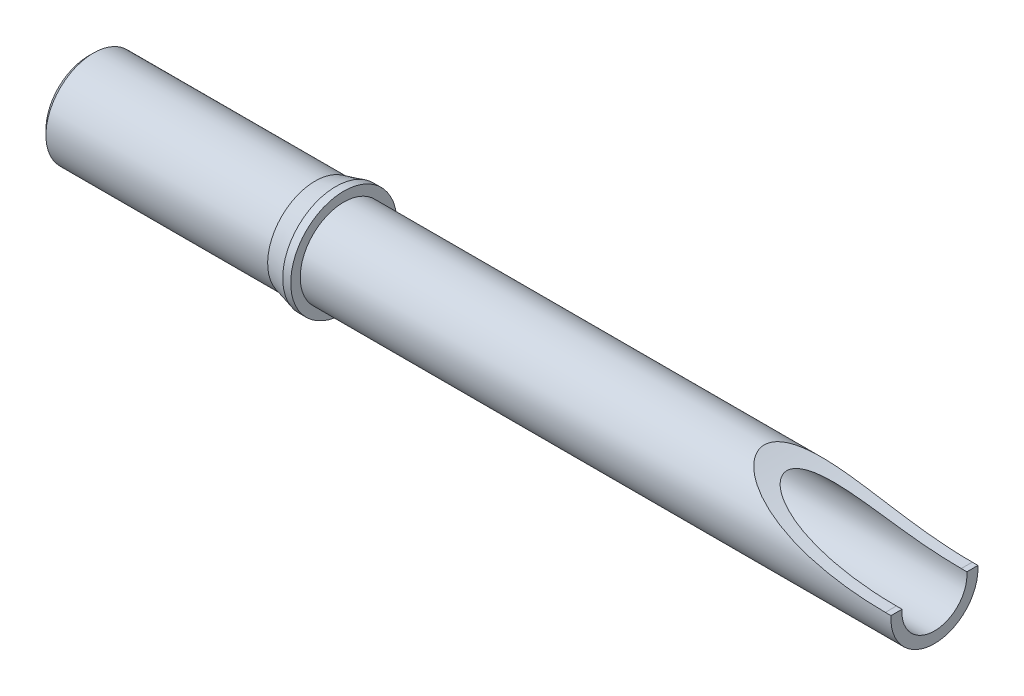
ISO-10303-21;
HEADER;
FILE_DESCRIPTION(('STEP AP214'),'2;1');
FILE_NAME('part.step','',(''),(''),'','','');
FILE_SCHEMA(('AUTOMOTIVE_DESIGN { 1 0 10303 214 1 1 1 1 }'));
ENDSEC;
DATA;
#1=APPLICATION_CONTEXT('core data for automotive mechanical design processes');
#2=APPLICATION_PROTOCOL_DEFINITION('international standard','automotive_design',2000,#1);
#3=PRODUCT_CONTEXT('',#1,'mechanical');
#4=PRODUCT('Part','Part','',(#3));
#5=PRODUCT_RELATED_PRODUCT_CATEGORY('part','',(#4));
#6=PRODUCT_DEFINITION_FORMATION('','',#4);
#7=PRODUCT_DEFINITION_CONTEXT('part definition',#1,'design');
#8=PRODUCT_DEFINITION('design','',#6,#7);
#9=PRODUCT_DEFINITION_SHAPE('','',#8);
#10=(LENGTH_UNIT() NAMED_UNIT(*) SI_UNIT(.MILLI.,.METRE.));
#11=(NAMED_UNIT(*) PLANE_ANGLE_UNIT() SI_UNIT($,.RADIAN.));
#12=(NAMED_UNIT(*) SI_UNIT($,.STERADIAN.) SOLID_ANGLE_UNIT());
#13=UNCERTAINTY_MEASURE_WITH_UNIT(LENGTH_MEASURE(1.E-05),#10,'distance_accuracy_value','');
#14=(GEOMETRIC_REPRESENTATION_CONTEXT(3) GLOBAL_UNCERTAINTY_ASSIGNED_CONTEXT((#13)) GLOBAL_UNIT_ASSIGNED_CONTEXT((#10,
#11,#12)) REPRESENTATION_CONTEXT('',''));
#15=CARTESIAN_POINT('',(0.,0.,0.));
#16=DIRECTION('',(0.,0.,1.));
#17=DIRECTION('',(1.,0.,0.));
#18=AXIS2_PLACEMENT_3D('',#15,#16,#17);
#19=CARTESIAN_POINT('',(3.84999999999991,0.,0.));
#20=DIRECTION('',(-1.,0.,0.));
#21=DIRECTION('',(0.,0.,1.));
#22=AXIS2_PLACEMENT_3D('',#19,#20,#21);
#23=CONICAL_SURFACE('',#22,0.315000000000509,1.04719755087034);
#24=CARTESIAN_POINT('',(4.0318653348379,-2.8421709430404E-11,0.));
#25=VERTEX_POINT('',#24);
#26=VERTEX_LOOP('',#25);
#27=FACE_BOUND('',#26,.T.);
#28=CARTESIAN_POINT('',(3.85,0.,0.));
#29=DIRECTION('',(-1.,0.,0.));
#30=DIRECTION('',(0.,0.,1.));
#31=AXIS2_PLACEMENT_3D('',#28,#29,#30);
#32=CIRCLE('',#31,0.315);
#33=CARTESIAN_POINT('',(3.85,0.,0.315));
#34=VERTEX_POINT('',#33);
#35=EDGE_CURVE('E69',#34,#34,#32,.T.);
#36=ORIENTED_EDGE('',*,*,#35,.T.);
#37=EDGE_LOOP('',(#36));
#38=FACE_BOUND('',#37,.T.);
#39=ADVANCED_FACE('F17',(#27,#38),#23,.F.);
#40=CARTESIAN_POINT('',(3.07598076211353,0.,0.));
#41=DIRECTION('',(-1.,0.,0.));
#42=DIRECTION('',(0.,0.,1.));
#43=AXIS2_PLACEMENT_3D('',#40,#41,#42);
#44=CYLINDRICAL_SURFACE('',#43,0.315);
#45=CARTESIAN_POINT('',(2.30196152421058,0.,0.));
#46=DIRECTION('',(-1.,0.,0.));
#47=DIRECTION('',(0.,1.,0.));
#48=AXIS2_PLACEMENT_3D('',#45,#46,#47);
#49=CIRCLE('',#48,0.315000000000509);
#50=CARTESIAN_POINT('',(2.30196152421058,0.315000000000509,0.));
#51=VERTEX_POINT('',#50);
#52=EDGE_CURVE('E71',#51,#51,#49,.T.);
#53=ORIENTED_EDGE('',*,*,#52,.T.);
#54=EDGE_LOOP('',(#53));
#55=FACE_BOUND('',#54,.T.);
#56=ORIENTED_EDGE('',*,*,#35,.F.);
#57=EDGE_LOOP('',(#56));
#58=FACE_BOUND('',#57,.T.);
#59=ADVANCED_FACE('F66',(#55,#58),#44,.F.);
#60=CARTESIAN_POINT('',(2.25000000000364,0.,0.));
#61=DIRECTION('',(-1.,0.,0.));
#62=DIRECTION('',(0.,0.,1.));
#63=AXIS2_PLACEMENT_3D('',#60,#61,#62);
#64=CONICAL_SURFACE('',#63,0.405000000000655,1.04719755136498);
#65=CARTESIAN_POINT('',(2.25,0.,0.));
#66=DIRECTION('',(-1.,0.,0.));
#67=DIRECTION('',(0.,0.,1.));
#68=AXIS2_PLACEMENT_3D('',#65,#66,#67);
#69=CIRCLE('',#68,0.405);
#70=CARTESIAN_POINT('',(2.25,0.,0.405));
#71=VERTEX_POINT('',#70);
#72=EDGE_CURVE('E74',#71,#71,#69,.T.);
#73=ORIENTED_EDGE('',*,*,#72,.T.);
#74=EDGE_LOOP('',(#73));
#75=FACE_BOUND('',#74,.T.);
#76=ORIENTED_EDGE('',*,*,#52,.F.);
#77=EDGE_LOOP('',(#76));
#78=FACE_BOUND('',#77,.T.);
#79=ADVANCED_FACE('F196',(#75,#78),#64,.F.);
#80=CARTESIAN_POINT('',(1.125,0.,0.));
#81=DIRECTION('',(-1.,0.,0.));
#82=DIRECTION('',(0.,0.,1.));
#83=AXIS2_PLACEMENT_3D('',#80,#81,#82);
#84=CYLINDRICAL_SURFACE('',#83,0.405);
#85=CARTESIAN_POINT('',(0.,0.,0.));
#86=DIRECTION('',(-1.,0.,0.));
#87=DIRECTION('',(0.,0.,1.));
#88=AXIS2_PLACEMENT_3D('',#85,#86,#87);
#89=CIRCLE('',#88,0.405);
#90=CARTESIAN_POINT('',(0.,0.,0.405));
#91=VERTEX_POINT('',#90);
#92=EDGE_CURVE('E20',#91,#91,#89,.T.);
#93=ORIENTED_EDGE('',*,*,#92,.T.);
#94=EDGE_LOOP('',(#93));
#95=FACE_BOUND('',#94,.T.);
#96=ORIENTED_EDGE('',*,*,#72,.F.);
#97=EDGE_LOOP('',(#96));
#98=FACE_BOUND('',#97,.T.);
#99=ADVANCED_FACE('F192',(#95,#98),#84,.F.);
#100=CARTESIAN_POINT('',(0.,-0.415,0.));
#101=DIRECTION('',(1.,0.,0.));
#102=DIRECTION('',(0.,0.,-1.));
#103=AXIS2_PLACEMENT_3D('',#100,#101,#102);
#104=PLANE('',#103);
#105=CARTESIAN_POINT('',(0.,0.,0.));
#106=DIRECTION('',(1.,0.,0.));
#107=DIRECTION('',(0.,0.,-1.));
#108=AXIS2_PLACEMENT_3D('',#105,#106,#107);
#109=CIRCLE('',#108,0.425000000007003);
#110=CARTESIAN_POINT('',(0.,0.,-0.425000000007003));
#111=VERTEX_POINT('',#110);
#112=EDGE_CURVE('E146',#111,#111,#109,.T.);
#113=ORIENTED_EDGE('',*,*,#112,.F.);
#114=EDGE_LOOP('',(#113));
#115=FACE_BOUND('',#114,.T.);
#116=ORIENTED_EDGE('',*,*,#92,.F.);
#117=EDGE_LOOP('',(#116));
#118=FACE_BOUND('',#117,.T.);
#119=ADVANCED_FACE('F189',(#115,#118),#104,.F.);
#120=CARTESIAN_POINT('',(0.049999999987449,0.,0.));
#121=DIRECTION('',(1.,0.,0.));
#122=DIRECTION('',(0.,0.,-1.));
#123=AXIS2_PLACEMENT_3D('',#120,#121,#122);
#124=CONICAL_SURFACE('',#123,0.474999999994452,0.785398163397448);
#125=ORIENTED_EDGE('',*,*,#112,.T.);
#126=EDGE_LOOP('',(#125));
#127=FACE_BOUND('',#126,.T.);
#128=CARTESIAN_POINT('',(0.0499999999999999,0.,0.));
#129=DIRECTION('',(1.,0.,0.));
#130=DIRECTION('',(0.,0.,-1.));
#131=AXIS2_PLACEMENT_3D('',#128,#129,#130);
#132=CIRCLE('',#131,0.475);
#133=CARTESIAN_POINT('',(0.0499999999999999,0.,-0.475));
#134=VERTEX_POINT('',#133);
#135=EDGE_CURVE('E144',#134,#134,#132,.T.);
#136=ORIENTED_EDGE('',*,*,#135,.F.);
#137=EDGE_LOOP('',(#136));
#138=FACE_BOUND('',#137,.T.);
#139=ADVANCED_FACE('F185',(#127,#138),#124,.T.);
#140=CARTESIAN_POINT('',(1.15736860279186,0.,0.));
#141=DIRECTION('',(1.,0.,0.));
#142=DIRECTION('',(0.,0.,-1.));
#143=AXIS2_PLACEMENT_3D('',#140,#141,#142);
#144=CYLINDRICAL_SURFACE('',#143,0.475);
#145=ORIENTED_EDGE('',*,*,#135,.T.);
#146=EDGE_LOOP('',(#145));
#147=FACE_BOUND('',#146,.T.);
#148=CARTESIAN_POINT('',(2.26473720556442,0.,0.));
#149=DIRECTION('',(1.,0.,0.));
#150=DIRECTION('',(0.,-1.,0.));
#151=AXIS2_PLACEMENT_3D('',#148,#149,#150);
#152=CIRCLE('',#151,0.474999999994452);
#153=CARTESIAN_POINT('',(2.26473720556442,-0.474999999994452,0.));
#154=VERTEX_POINT('',#153);
#155=EDGE_CURVE('E141',#154,#154,#152,.T.);
#156=ORIENTED_EDGE('',*,*,#155,.F.);
#157=EDGE_LOOP('',(#156));
#158=FACE_BOUND('',#157,.T.);
#159=ADVANCED_FACE('F181',(#147,#158),#144,.T.);
#160=CARTESIAN_POINT('',(2.47000000001663,0.,0.));
#161=DIRECTION('',(1.,0.,0.));
#162=DIRECTION('',(0.,0.,-1.));
#163=AXIS2_PLACEMENT_3D('',#160,#161,#162);
#164=CONICAL_SURFACE('',#163,0.530000000026121,0.261799387899347);
#165=ORIENTED_EDGE('',*,*,#155,.T.);
#166=EDGE_LOOP('',(#165));
#167=FACE_BOUND('',#166,.T.);
#168=CARTESIAN_POINT('',(2.47,0.,0.));
#169=DIRECTION('',(1.,0.,0.));
#170=DIRECTION('',(0.,0.,-1.));
#171=AXIS2_PLACEMENT_3D('',#168,#169,#170);
#172=CIRCLE('',#171,0.53);
#173=CARTESIAN_POINT('',(2.47,0.,-0.53));
#174=VERTEX_POINT('',#173);
#175=EDGE_CURVE('E136',#174,#174,#172,.T.);
#176=ORIENTED_EDGE('',*,*,#175,.F.);
#177=EDGE_LOOP('',(#176));
#178=FACE_BOUND('',#177,.T.);
#179=ADVANCED_FACE('F178',(#167,#178),#164,.T.);
#180=CARTESIAN_POINT('',(6.45000000002938,0.,0.));
#181=DIRECTION('',(1.,0.,0.));
#182=DIRECTION('',(0.,0.,-1.));
#183=AXIS2_PLACEMENT_3D('',#180,#181,#182);
#184=CONICAL_SURFACE('',#183,0.325000000032105,1.04719755106167);
#185=CARTESIAN_POINT('',(6.26236116249856,8.5265128291212E-11,0.));
#186=VERTEX_POINT('',#185);
#187=VERTEX_LOOP('',#186);
#188=FACE_BOUND('',#187,.T.);
#189=CARTESIAN_POINT('',(6.45,0.,0.));
#190=DIRECTION('',(-1.,0.,0.));
#191=DIRECTION('',(0.,0.,1.));
#192=AXIS2_PLACEMENT_3D('',#189,#190,#191);
#193=CIRCLE('',#192,0.325);
#194=CARTESIAN_POINT('',(6.45,0.,0.325));
#195=VERTEX_POINT('',#194);
#196=EDGE_CURVE('E134',#195,#195,#193,.F.);
#197=ORIENTED_EDGE('',*,*,#196,.T.);
#198=EDGE_LOOP('',(#197));
#199=FACE_BOUND('',#198,.T.);
#200=ADVANCED_FACE('F174',(#188,#199),#184,.F.);
#201=CARTESIAN_POINT('',(2.51,0.,0.));
#202=DIRECTION('',(1.,0.,0.));
#203=DIRECTION('',(0.,0.,-1.));
#204=AXIS2_PLACEMENT_3D('',#201,#202,#203);
#205=CYLINDRICAL_SURFACE('',#204,0.53);
#206=ORIENTED_EDGE('',*,*,#175,.T.);
#207=EDGE_LOOP('',(#206));
#208=FACE_BOUND('',#207,.T.);
#209=CARTESIAN_POINT('',(2.55,0.,0.));
#210=DIRECTION('',(1.,0.,0.));
#211=DIRECTION('',(0.,0.,-1.));
#212=AXIS2_PLACEMENT_3D('',#209,#210,#211);
#213=CIRCLE('',#212,0.53);
#214=CARTESIAN_POINT('',(2.55,0.,-0.53));
#215=VERTEX_POINT('',#214);
#216=EDGE_CURVE('E126',#215,#215,#213,.T.);
#217=ORIENTED_EDGE('',*,*,#216,.F.);
#218=EDGE_LOOP('',(#217));
#219=FACE_BOUND('',#218,.T.);
#220=ADVANCED_FACE('F171',(#208,#219),#205,.T.);
#221=CARTESIAN_POINT('',(8.741134,0.0250000000000025,-0.6360024));
#222=DIRECTION('',(0.,-1.,0.));
#223=DIRECTION('',(0.,0.,-1.));
#224=AXIS2_PLACEMENT_3D('',#221,#222,#223);
#225=PLANE('',#224);
#226=DIRECTION('',(0.,0.,-1.));
#227=VECTOR('',#226,1.);
#228=CARTESIAN_POINT('',(8.45,0.0250000000000023,0.));
#229=LINE('',#228,#227);
#230=CARTESIAN_POINT('',(8.45,0.0250000000000023,0.324037034920393));
#231=VERTEX_POINT('',#230);
#232=CARTESIAN_POINT('',(8.45,0.0250000000000024,0.434281015012169));
#233=VERTEX_POINT('',#232);
#234=EDGE_CURVE('E130',#231,#233,#229,.F.);
#235=ORIENTED_EDGE('',*,*,#234,.F.);
#236=DIRECTION('',(-1.,0.,0.));
#237=VECTOR('',#236,1.);
#238=CARTESIAN_POINT('',(7.45,0.0250000000000023,0.324037034920393));
#239=LINE('',#238,#237);
#240=CARTESIAN_POINT('',(8.39374572243609,0.0249999999943942,0.324037034920825));
#241=VERTEX_POINT('',#240);
#242=EDGE_CURVE('E58',#231,#241,#239,.T.);
#243=ORIENTED_EDGE('',*,*,#242,.T.);
#244=DIRECTION('',(0.,0.,1.));
#245=VECTOR('',#244,1.);
#246=CARTESIAN_POINT('',(8.39374572243609,0.0249999999999998,-0.6360024));
#247=LINE('',#246,#245);
#248=CARTESIAN_POINT('',(8.39374572243199,0.0250000000000012,0.434281015012169));
#249=VERTEX_POINT('',#248);
#250=EDGE_CURVE('E120',#241,#249,#247,.T.);
#251=ORIENTED_EDGE('',*,*,#250,.T.);
#252=DIRECTION('',(1.,0.,0.));
#253=VECTOR('',#252,1.);
#254=CARTESIAN_POINT('',(5.5,0.0250000000000025,0.434281015012169));
#255=LINE('',#254,#253);
#256=EDGE_CURVE('E117',#233,#249,#255,.F.);
#257=ORIENTED_EDGE('',*,*,#256,.F.);
#258=EDGE_LOOP('',(#235,#243,#251,#257));
#259=FACE_BOUND('',#258,.T.);
#260=ADVANCED_FACE('F122',(#259),#225,.F.);
#261=CARTESIAN_POINT('',(7.45,0.,0.));
#262=DIRECTION('',(-1.,0.,0.));
#263=DIRECTION('',(0.,0.,1.));
#264=AXIS2_PLACEMENT_3D('',#261,#262,#263);
#265=CYLINDRICAL_SURFACE('',#264,0.325);
#266=CARTESIAN_POINT('',(8.45,0.,0.));
#267=DIRECTION('',(-1.,0.,0.));
#268=DIRECTION('',(0.,0.,1.));
#269=AXIS2_PLACEMENT_3D('',#266,#267,#268);
#270=CIRCLE('',#269,0.325);
#271=CARTESIAN_POINT('',(8.45,0.0250000000000025,-0.324037034920393));
#272=VERTEX_POINT('',#271);
#273=EDGE_CURVE('E132',#272,#231,#270,.T.);
#274=ORIENTED_EDGE('',*,*,#273,.F.);
#275=DIRECTION('',(-1.,0.,0.));
#276=VECTOR('',#275,1.);
#277=CARTESIAN_POINT('',(7.45,0.0250000000000026,-0.324037034920393));
#278=LINE('',#277,#276);
#279=CARTESIAN_POINT('',(8.39374572242789,0.0250000000000011,-0.324037034920393));
#280=VERTEX_POINT('',#279);
#281=EDGE_CURVE('E108',#280,#272,#278,.F.);
#282=ORIENTED_EDGE('',*,*,#281,.F.);
#283=CARTESIAN_POINT('',(8.39374572242789,0.0249999999999997,-0.324037034920393));
#284=CARTESIAN_POINT('',(8.33977240195797,0.0249989085232508,-0.324005447994192));
#285=CARTESIAN_POINT('',(8.28579800782878,0.0262484336025015,-0.323939465875294));
#286=CARTESIAN_POINT('',(8.17793752684025,0.0312425668142694,-0.323513073549284));
#287=CARTESIAN_POINT('',(8.12405150176104,0.0349884938328785,-0.323152507686458));
#288=CARTESIAN_POINT('',(8.0155115725951,0.0450624485153899,-0.321899274228068));
#289=CARTESIAN_POINT('',(7.96086211796444,0.0514373837107549,-0.320996796822902));
#290=CARTESIAN_POINT('',(7.85196246464693,0.0667501181971932,-0.318168060156125));
#291=CARTESIAN_POINT('',(7.79771214071554,0.075687074996195,-0.316242137265648));
#292=CARTESIAN_POINT('',(7.70364132435875,0.09346648394239,-0.311368291097941));
#293=CARTESIAN_POINT('',(7.66369371357479,0.10174355925719,-0.308809953247888));
#294=CARTESIAN_POINT('',(7.58422055125246,0.119661994791373,-0.302319804336781));
#295=CARTESIAN_POINT('',(7.54469490617224,0.129303045593088,-0.298388304481079));
#296=CARTESIAN_POINT('',(7.46654402415794,0.14980874760507,-0.288635216233257));
#297=CARTESIAN_POINT('',(7.42791405596287,0.160662686131048,-0.282829434622625));
#298=CARTESIAN_POINT('',(7.35151640335671,0.183541977661429,-0.268553503883496));
#299=CARTESIAN_POINT('',(7.31374775903353,0.195565939172205,-0.260086493618117));
#300=CARTESIAN_POINT('',(7.2570440363563,0.214661617699033,-0.24416896312924));
#301=CARTESIAN_POINT('',(7.23760730516824,0.221402118907211,-0.23811398165814));
#302=CARTESIAN_POINT('',(7.19916949416747,0.23510558508265,-0.224596206798637));
#303=CARTESIAN_POINT('',(7.18017128525042,0.242069543517538,-0.217126088689695));
#304=CARTESIAN_POINT('',(7.13675270246543,0.258400677970953,-0.197656040897632));
#305=CARTESIAN_POINT('',(7.11264190311652,0.267793281888343,-0.184976567648855));
#306=CARTESIAN_POINT('',(7.06710990552417,0.286077537622108,-0.155210260025325));
#307=CARTESIAN_POINT('',(7.04566528877509,0.294973107055613,-0.138166530111696));
#308=CARTESIAN_POINT('',(7.020845975393,0.305497471501751,-0.11112486819036));
#309=CARTESIAN_POINT('',(7.0148830632025,0.308048889270588,-0.103895910168277));
#310=CARTESIAN_POINT('',(7.00388668885341,0.312784742800779,-0.08862837893123));
#311=CARTESIAN_POINT('',(6.99885395493897,0.314968890904059,-0.0805891789161792));
#312=CARTESIAN_POINT('',(6.98998474083136,0.318837314986143,-0.0635971723649303));
#313=CARTESIAN_POINT('',(6.98616620882698,0.320514074780998,-0.0546330409908441));
#314=CARTESIAN_POINT('',(6.9802329433907,0.323126718584623,-0.0360672264751326));
#315=CARTESIAN_POINT('',(6.97811086681342,0.324065795360443,-0.0264684879684488));
#316=CARTESIAN_POINT('',(6.97665211152017,0.324711615883743,-0.0139727461839899));
#317=CARTESIAN_POINT('',(6.97640853671182,0.324819484833887,-0.0111855825725382));
#318=CARTESIAN_POINT('',(6.97608282509984,0.324963758732013,-0.00559942199124737));
#319=CARTESIAN_POINT('',(6.97600071752555,0.325000150740996,-0.00280042297080788));
#320=CARTESIAN_POINT('',(6.97600194471867,0.324999567230537,0.00803986690812112));
#321=CARTESIAN_POINT('',(6.97668222636173,0.324697936739121,0.016091470497455));
#322=CARTESIAN_POINT('',(6.97933465314808,0.323524826292172,0.0319423878194288));
#323=CARTESIAN_POINT('',(6.98130990519875,0.32265197586842,0.0397410473410702));
#324=CARTESIAN_POINT('',(6.98692564981797,0.320180434261269,0.0565358742437367));
#325=CARTESIAN_POINT('',(6.99083465459348,0.318465265279281,0.0654242153537825));
#326=CARTESIAN_POINT('',(6.999921711061,0.314504822288374,0.0823894153697179));
#327=CARTESIAN_POINT('',(7.00510181773789,0.31225869009119,0.0904649300686681));
#328=CARTESIAN_POINT('',(7.01959602312257,0.306024377647468,0.110152171773914));
#329=CARTESIAN_POINT('',(7.0295892004588,0.301770353624681,0.121174204161475));
#330=CARTESIAN_POINT('',(7.05099633762553,0.29279314485358,0.141493354756771));
#331=CARTESIAN_POINT('',(7.06241372906677,0.288068832706813,0.150786166917144));
#332=CARTESIAN_POINT('',(7.0975322828378,0.27377671466117,0.176204242034975));
#333=CARTESIAN_POINT('',(7.12252504665341,0.263903671444218,0.190348923922493));
#334=CARTESIAN_POINT('',(7.17422735600959,0.244214404816268,0.21501017079278));
#335=CARTESIAN_POINT('',(7.20094199339591,0.234398453183047,0.22551532888149));
#336=CARTESIAN_POINT('',(7.26925018158767,0.210275336048696,0.248629927689878));
#337=CARTESIAN_POINT('',(7.31148861389341,0.19622849814167,0.259583721452463));
#338=CARTESIAN_POINT('',(7.39723244653791,0.169557729991976,0.277724770459205));
#339=CARTESIAN_POINT('',(7.44074042747806,0.156936994982452,0.284903694396859));
#340=CARTESIAN_POINT('',(7.52881910165993,0.133246171579972,0.296726544180407));
#341=CARTESIAN_POINT('',(7.57339490908747,0.122186851378868,0.301353450575572));
#342=CARTESIAN_POINT('',(7.66303837026779,0.101817355645525,0.30882858506165));
#343=CARTESIAN_POINT('',(7.70810555441578,0.0925056425765856,0.311678381822112));
#344=CARTESIAN_POINT('',(7.80656910698719,0.0741810176932843,0.316587498769827));
#345=CARTESIAN_POINT('',(7.86003955288731,0.0655071646214539,0.318420408223402));
#346=CARTESIAN_POINT('',(7.96736581105568,0.0506457993978664,0.321117306598196));
#347=CARTESIAN_POINT('',(8.02122176588187,0.0444592611254709,0.321980916237924));
#348=CARTESIAN_POINT('',(8.12815220880176,0.0346866194950688,0.323182541368462));
#349=CARTESIAN_POINT('',(8.1812223385685,0.0310537858840328,0.323530138761109));
#350=CARTESIAN_POINT('',(8.28744389152478,0.0262106634756745,0.323942477470566));
#351=CARTESIAN_POINT('',(8.34059525091166,0.0249989912084228,0.324007380346192));
#352=CARTESIAN_POINT('',(8.39374572243609,0.0249999999999996,0.324037034920394));
#353=B_SPLINE_CURVE_WITH_KNOTS('',3,(#283,#284,#285,#286,#287,#288,#289,#290,#291,#292,#293,
#294,#295,#296,#297,#298,#299,#300,#301,#302,#303,#304,#305,#306,#307,#308,#309,#310,#311,#312,
#313,#314,#315,#316,#317,#318,#319,#320,#321,#322,#323,#324,#325,#326,#327,#328,#329,#330,#331,
#332,#333,#334,#335,#336,#337,#338,#339,#340,#341,#342,#343,#344,#345,#346,#347,#348,#349,#350,
#351,#352),.UNSPECIFIED.,.F.,.F.,(4,2,2,2,2,2,2,2,2,2,2,2,2,2,2,2,2,2,2,2,2,2,2,2,2,2,2,2,2,2,2,
2,2,2,4),(0.,0.161907313690547,0.323900233293442,0.488917920618023,0.65388140584961,
0.776471740515459,0.899034310038265,1.02058912628053,1.14200110582414,1.20629830190467,
1.2709378716929,1.35717784394607,1.44259686291142,1.47166724583187,1.50076029266631,
1.53026530018981,1.55964189244282,1.56803739271876,1.57643441263658,1.60054181472113,
1.6247072682656,1.65412164217633,1.68358388716172,1.72974355897265,1.77601668128837,
1.86660874309312,1.95748222055342,2.09466357762496,2.23214644259113,2.3705354266217,
2.50880207997651,2.6713273993543,2.83391629181622,2.9934465459805,3.15288561725211),.UNSPECIFIED.);
#354=EDGE_CURVE('E123',#280,#241,#353,.T.);
#355=ORIENTED_EDGE('',*,*,#354,.T.);
#356=ORIENTED_EDGE('',*,*,#242,.F.);
#357=EDGE_LOOP('',(#274,#282,#355,#356));
#358=FACE_BOUND('',#357,.T.);
#359=ORIENTED_EDGE('',*,*,#196,.F.);
#360=EDGE_LOOP('',(#359));
#361=FACE_BOUND('',#360,.T.);
#362=ADVANCED_FACE('F163',(#358,#361),#265,.F.);
#363=CARTESIAN_POINT('',(8.45,-0.38,0.));
#364=DIRECTION('',(1.,0.,0.));
#365=DIRECTION('',(0.,0.,-1.));
#366=AXIS2_PLACEMENT_3D('',#363,#364,#365);
#367=PLANE('',#366);
#368=ORIENTED_EDGE('',*,*,#234,.T.);
#369=CARTESIAN_POINT('',(8.45,0.,0.));
#370=DIRECTION('',(1.,0.,0.));
#371=DIRECTION('',(0.,0.,-1.));
#372=AXIS2_PLACEMENT_3D('',#369,#370,#371);
#373=CIRCLE('',#372,0.435);
#374=CARTESIAN_POINT('',(8.45,0.0250000000000026,-0.434281015012169));
#375=VERTEX_POINT('',#374);
#376=EDGE_CURVE('E111',#375,#233,#373,.F.);
#377=ORIENTED_EDGE('',*,*,#376,.F.);
#378=DIRECTION('',(0.,0.,-1.));
#379=VECTOR('',#378,1.);
#380=CARTESIAN_POINT('',(8.45,0.0250000000000025,-0.6360024));
#381=LINE('',#380,#379);
#382=EDGE_CURVE('E106',#375,#272,#381,.F.);
#383=ORIENTED_EDGE('',*,*,#382,.T.);
#384=ORIENTED_EDGE('',*,*,#273,.T.);
#385=EDGE_LOOP('',(#368,#377,#383,#384));
#386=FACE_BOUND('',#385,.T.);
#387=ADVANCED_FACE('F168',(#386),#367,.T.);
#388=CARTESIAN_POINT('',(2.55,-0.4825,0.));
#389=DIRECTION('',(1.,0.,0.));
#390=DIRECTION('',(0.,0.,-1.));
#391=AXIS2_PLACEMENT_3D('',#388,#389,#390);
#392=PLANE('',#391);
#393=CARTESIAN_POINT('',(2.55,0.,0.));
#394=DIRECTION('',(1.,0.,0.));
#395=DIRECTION('',(0.,0.,-1.));
#396=AXIS2_PLACEMENT_3D('',#393,#394,#395);
#397=CIRCLE('',#396,0.435);
#398=CARTESIAN_POINT('',(2.55,0.,-0.435));
#399=VERTEX_POINT('',#398);
#400=EDGE_CURVE('E85',#399,#399,#397,.T.);
#401=ORIENTED_EDGE('',*,*,#400,.F.);
#402=EDGE_LOOP('',(#401));
#403=FACE_BOUND('',#402,.T.);
#404=ORIENTED_EDGE('',*,*,#216,.T.);
#405=EDGE_LOOP('',(#404));
#406=FACE_BOUND('',#405,.T.);
#407=ADVANCED_FACE('F102',(#403,#406),#392,.T.);
#408=CARTESIAN_POINT('',(8.39374572242789,3.525,-0.6360024));
#409=DIRECTION('',(0.,0.,1.));
#410=DIRECTION('',(1.,0.,0.));
#411=AXIS2_PLACEMENT_3D('',#408,#409,#410);
#412=CYLINDRICAL_SURFACE('',#411,3.5);
#413=ORIENTED_EDGE('',*,*,#354,.F.);
#414=DIRECTION('',(0.,0.,-1.));
#415=VECTOR('',#414,1.);
#416=CARTESIAN_POINT('',(8.39374572242789,0.0250000000000025,-0.6360024));
#417=LINE('',#416,#415);
#418=CARTESIAN_POINT('',(8.39374572242789,0.0250000000000026,-0.434281015012169));
#419=VERTEX_POINT('',#418);
#420=EDGE_CURVE('E35',#280,#419,#417,.T.);
#421=ORIENTED_EDGE('',*,*,#420,.T.);
#422=CARTESIAN_POINT('',(8.39374572242789,0.0249999999999999,0.434281015012169));
#423=CARTESIAN_POINT('',(8.35705207970473,0.0250000405403564,0.434277423303114));
#424=CARTESIAN_POINT('',(8.32036106326547,0.0255771007283895,0.434248307314484));
#425=CARTESIAN_POINT('',(8.24701467484558,0.0278845355050211,0.434107526129756));
#426=CARTESIAN_POINT('',(8.21035930366893,0.0296149355294181,0.433995859113068));
#427=CARTESIAN_POINT('',(8.10040082140524,0.0365409314523662,0.433489347014583));
#428=CARTESIAN_POINT('',(8.02719954379417,0.0434713231009414,0.432922838247065));
#429=CARTESIAN_POINT('',(7.88167884269628,0.0618876378365196,0.430673997595906));
#430=CARTESIAN_POINT('',(7.80935711232187,0.0733559660015932,0.428995958702203));
#431=CARTESIAN_POINT('',(7.66569902787848,0.100779464105476,0.423398815429078));
#432=CARTESIAN_POINT('',(7.59436186114966,0.11673066868058,0.419481688500697));
#433=CARTESIAN_POINT('',(7.47806844808536,0.14657442513623,0.409745403249997));
#434=CARTESIAN_POINT('',(7.43269285238349,0.159204535920181,0.40508652273369));
#435=CARTESIAN_POINT('',(7.34264157065719,0.186228054662589,0.393397244645921));
#436=CARTESIAN_POINT('',(7.2979680908272,0.200626105686579,0.386360513600426));
#437=CARTESIAN_POINT('',(7.20136329352366,0.233907399147867,0.367359557670633));
#438=CARTESIAN_POINT('',(7.14966533142622,0.253123095647025,0.354713220330221));
#439=CARTESIAN_POINT('',(7.07436491023171,0.283092160213415,0.330521436809277));
#440=CARTESIAN_POINT('',(7.04968260338618,0.293253003703724,0.321608323091267));
#441=CARTESIAN_POINT('',(7.00132301704256,0.313793842474026,0.30160442075086));
#442=CARTESIAN_POINT('',(6.97764457576296,0.324173562381339,0.290516237929982));
#443=CARTESIAN_POINT('',(6.93813914366687,0.341991923273313,0.269076842168117));
#444=CARTESIAN_POINT('',(6.92196400951041,0.349443552215914,0.259382375074506));
#445=CARTESIAN_POINT('',(6.89062086205292,0.364159137111931,0.238283378875942));
#446=CARTESIAN_POINT('',(6.8754542051383,0.371422832589627,0.226876611300919));
#447=CARTESIAN_POINT('',(6.84643884447664,0.385556708219294,0.201938039284636));
#448=CARTESIAN_POINT('',(6.8326049294482,0.392422196094377,0.188386016996657));
#449=CARTESIAN_POINT('',(6.80715474807101,0.405235464325178,0.158949939290361));
#450=CARTESIAN_POINT('',(6.79553248536107,0.411185717461487,0.143072402199386));
#451=CARTESIAN_POINT('',(6.77920488160771,0.419632101757068,0.115160714766481));
#452=CARTESIAN_POINT('',(6.7735237600951,0.422595969906406,0.103841578862898));
#453=CARTESIAN_POINT('',(6.76381693811667,0.427684671366049,0.0803399462590678));
#454=CARTESIAN_POINT('',(6.75978818985079,0.429811049135696,0.0681590881275096));
#455=CARTESIAN_POINT('',(6.75453378416524,0.43259147654263,0.0466175832434432));
#456=CARTESIAN_POINT('',(6.75284220495482,0.433489478063874,0.0374008844968381));
#457=CARTESIAN_POINT('',(6.75057490624626,0.434693978957828,0.0187906180011162));
#458=CARTESIAN_POINT('',(6.7499992551334,0.435000442080423,0.00939703944822882));
#459=CARTESIAN_POINT('',(6.75000096930723,0.434999424713428,-0.012228522990296));
#460=CARTESIAN_POINT('',(6.75097802184519,0.434479128553078,-0.0244629067465002));
#461=CARTESIAN_POINT('',(6.75479857558726,0.432451434038154,-0.0485535350925057));
#462=CARTESIAN_POINT('',(6.75764391167853,0.430943065276667,-0.0604093959096377));
#463=CARTESIAN_POINT('',(6.76494374352021,0.427094140154154,-0.0833687587469123));
#464=CARTESIAN_POINT('',(6.76938701613794,0.424759389661965,-0.094476882035484));
#465=CARTESIAN_POINT('',(6.77960633151361,0.419426395057449,-0.115880815772918));
#466=CARTESIAN_POINT('',(6.78538283739397,0.416427920403519,-0.126176342280174));
#467=CARTESIAN_POINT('',(6.80231485470488,0.407711347473651,-0.152651835647741));
#468=CARTESIAN_POINT('',(6.81445089184068,0.401533766654336,-0.168052495940431));
#469=CARTESIAN_POINT('',(6.84077118987259,0.38836330654922,-0.196587898435909));
#470=CARTESIAN_POINT('',(6.85496168346229,0.381367959272754,-0.209715468499027));
#471=CARTESIAN_POINT('',(6.8960318875944,0.361506696965461,-0.243225458848941));
#472=CARTESIAN_POINT('',(6.9243674986106,0.348215090826373,-0.261551277935396));
#473=CARTESIAN_POINT('',(6.98340655701426,0.32156329691128,-0.293693622776123));
#474=CARTESIAN_POINT('',(7.01411552992593,0.308203021086386,-0.307499208454069));
#475=CARTESIAN_POINT('',(7.07901960488244,0.281112132695423,-0.332507710917863));
#476=CARTESIAN_POINT('',(7.11331202698657,0.267412567106938,-0.343487428210941));
#477=CARTESIAN_POINT('',(7.18301933406277,0.240865836342046,-0.362595474465074));
#478=CARTESIAN_POINT('',(7.21843541954463,0.228019631533193,-0.370720633574793));
#479=CARTESIAN_POINT('',(7.29024020325379,0.20329481217026,-0.38483734204133));
#480=CARTESIAN_POINT('',(7.32663321000873,0.19142196617908,-0.390816794096911));
#481=CARTESIAN_POINT('',(7.39998333069729,0.168825076614929,-0.401093598055883));
#482=CARTESIAN_POINT('',(7.43694021732541,0.15810058341458,-0.405391610074288));
#483=CARTESIAN_POINT('',(7.5495562968985,0.127434774423699,-0.41649526826719));
#484=CARTESIAN_POINT('',(7.62592250603649,0.109360128946442,-0.421332701894398));
#485=CARTESIAN_POINT('',(7.7798647466517,0.0783593787529089,-0.42817384736408));
#486=CARTESIAN_POINT('',(7.85744204917473,0.0654391222654305,-0.430174346923382));
#487=CARTESIAN_POINT('',(8.01139966654936,0.0451022132472768,-0.432774466745934));
#488=CARTESIAN_POINT('',(8.08776245904813,0.0375579508142978,-0.433407348738017));
#489=CARTESIAN_POINT('',(8.2024710279646,0.0300207374852796,-0.433968932090027));
#490=CARTESIAN_POINT('',(8.24070119393352,0.0281381960068219,-0.434091564821975));
#491=CARTESIAN_POINT('',(8.31720180969252,0.0256278779671369,-0.434245471891336));
#492=CARTESIAN_POINT('',(8.35547225830393,0.0250000656607742,-0.434276748831335));
#493=CARTESIAN_POINT('',(8.39374572242788,0.0249999999999962,-0.434281015012271));
#494=B_SPLINE_CURVE_WITH_KNOTS('',3,(#422,#423,#424,#425,#426,#427,#428,#429,#430,#431,#432,
#433,#434,#435,#436,#437,#438,#439,#440,#441,#442,#443,#444,#445,#446,#447,#448,#449,#450,#451,
#452,#453,#454,#455,#456,#457,#458,#459,#460,#461,#462,#463,#464,#465,#466,#467,#468,#469,#470,
#471,#472,#473,#474,#475,#476,#477,#478,#479,#480,#481,#482,#483,#484,#485,#486,#487,#488,#489,
#490,#491,#492,#493),.UNSPECIFIED.,.F.,.F.,(4,2,2,2,2,2,2,2,2,2,2,2,2,2,2,2,2,2,2,2,2,2,2,2,2,2,
2,2,2,2,2,2,2,2,2,4),(0.,0.110071106061665,0.220144639715803,0.44057380800635,0.660156552758553,
0.879545671921991,1.02145511592713,1.16374555882823,1.33306579538373,1.41741571890025,
1.50166519901098,1.56242074504514,1.62325641914459,1.6847039198165,1.74598236966947,
1.78487390488461,1.82369337856801,1.85185424385961,1.88001683482486,1.91666528064466,
1.95334977374809,1.98978148958389,2.02622587972506,2.08754230135996,2.14904879853334,
2.25724109946939,2.36569334940802,2.4810885536554,2.59661149675707,2.71277587748585,
2.82889460747075,3.06445656687225,3.30028504257445,3.53031019665335,3.64512264140626,
3.75993181529804),.UNSPECIFIED.);
#495=EDGE_CURVE('E26',#249,#419,#494,.T.);
#496=ORIENTED_EDGE('',*,*,#495,.F.);
#497=ORIENTED_EDGE('',*,*,#250,.F.);
#498=EDGE_LOOP('',(#413,#421,#496,#497));
#499=FACE_BOUND('',#498,.T.);
#500=ADVANCED_FACE('F87',(#499),#412,.F.);
#501=CARTESIAN_POINT('',(8.741134,0.0250000000000025,-0.6360024));
#502=DIRECTION('',(0.,-1.,0.));
#503=DIRECTION('',(0.,0.,-1.));
#504=AXIS2_PLACEMENT_3D('',#501,#502,#503);
#505=PLANE('',#504);
#506=ORIENTED_EDGE('',*,*,#382,.F.);
#507=DIRECTION('',(1.,0.,0.));
#508=VECTOR('',#507,1.);
#509=CARTESIAN_POINT('',(5.5,0.0250000000000026,-0.434281015012169));
#510=LINE('',#509,#508);
#511=EDGE_CURVE('E11',#419,#375,#510,.T.);
#512=ORIENTED_EDGE('',*,*,#511,.F.);
#513=ORIENTED_EDGE('',*,*,#420,.F.);
#514=ORIENTED_EDGE('',*,*,#281,.T.);
#515=EDGE_LOOP('',(#506,#512,#513,#514));
#516=FACE_BOUND('',#515,.T.);
#517=ADVANCED_FACE('F94',(#516),#505,.F.);
#518=CARTESIAN_POINT('',(5.5,0.,0.));
#519=DIRECTION('',(1.,0.,0.));
#520=DIRECTION('',(0.,0.,-1.));
#521=AXIS2_PLACEMENT_3D('',#518,#519,#520);
#522=CYLINDRICAL_SURFACE('',#521,0.435);
#523=ORIENTED_EDGE('',*,*,#400,.T.);
#524=EDGE_LOOP('',(#523));
#525=FACE_BOUND('',#524,.T.);
#526=ORIENTED_EDGE('',*,*,#495,.T.);
#527=ORIENTED_EDGE('',*,*,#511,.T.);
#528=ORIENTED_EDGE('',*,*,#376,.T.);
#529=ORIENTED_EDGE('',*,*,#256,.T.);
#530=EDGE_LOOP('',(#526,#527,#528,#529));
#531=FACE_BOUND('',#530,.T.);
#532=ADVANCED_FACE('F91',(#525,#531),#522,.T.);
#533=CLOSED_SHELL('',(#39,#59,#79,#99,#119,#139,#159,#179,#200,#220,#260,#362,#387,#407,#500,
#517,#532));
#534=MANIFOLD_SOLID_BREP('B1',#533);
#535=ADVANCED_BREP_SHAPE_REPRESENTATION('',(#18,#534),#14);
#536=SHAPE_DEFINITION_REPRESENTATION(#9,#535);
ENDSEC;
END-ISO-10303-21;
